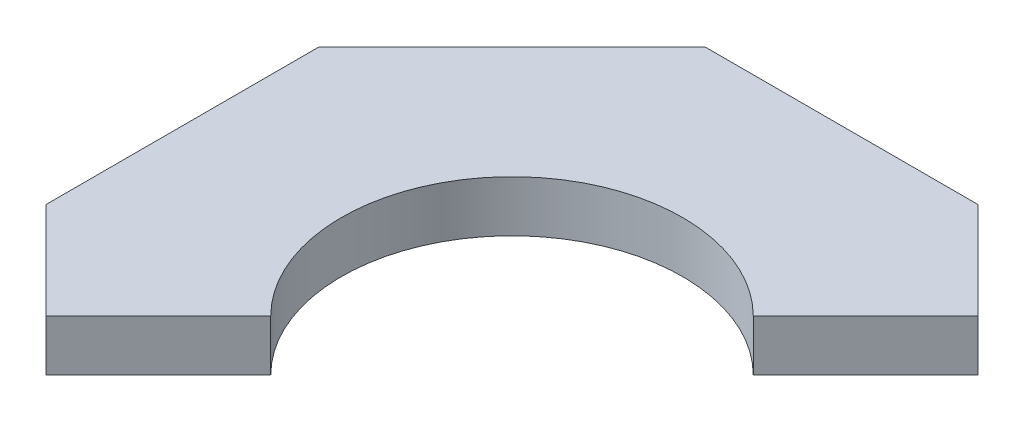
ISO-10303-21;
HEADER;
FILE_DESCRIPTION(('STEP AP214'),'2;1');
FILE_NAME('part.step','',(''),(''),'','','');
FILE_SCHEMA(('AUTOMOTIVE_DESIGN { 1 0 10303 214 1 1 1 1 }'));
ENDSEC;
DATA;
#1=APPLICATION_CONTEXT('core data for automotive mechanical design processes');
#2=APPLICATION_PROTOCOL_DEFINITION('international standard','automotive_design',2000,#1);
#3=PRODUCT_CONTEXT('',#1,'mechanical');
#4=PRODUCT('Part','Part','',(#3));
#5=PRODUCT_RELATED_PRODUCT_CATEGORY('part','',(#4));
#6=PRODUCT_DEFINITION_FORMATION('','',#4);
#7=PRODUCT_DEFINITION_CONTEXT('part definition',#1,'design');
#8=PRODUCT_DEFINITION('design','',#6,#7);
#9=PRODUCT_DEFINITION_SHAPE('','',#8);
#10=(LENGTH_UNIT() NAMED_UNIT(*) SI_UNIT(.MILLI.,.METRE.));
#11=(NAMED_UNIT(*) PLANE_ANGLE_UNIT() SI_UNIT($,.RADIAN.));
#12=(NAMED_UNIT(*) SI_UNIT($,.STERADIAN.) SOLID_ANGLE_UNIT());
#13=UNCERTAINTY_MEASURE_WITH_UNIT(LENGTH_MEASURE(1.E-05),#10,'distance_accuracy_value','');
#14=(GEOMETRIC_REPRESENTATION_CONTEXT(3) GLOBAL_UNCERTAINTY_ASSIGNED_CONTEXT((#13)) GLOBAL_UNIT_ASSIGNED_CONTEXT((#10,
#11,#12)) REPRESENTATION_CONTEXT('',''));
#15=CARTESIAN_POINT('',(0.,0.,0.));
#16=DIRECTION('',(0.,0.,1.));
#17=DIRECTION('',(1.,0.,0.));
#18=AXIS2_PLACEMENT_3D('',#15,#16,#17);
#19=CARTESIAN_POINT('',(-86.7210244842766,-0.00999999999999959,86.7210244842766));
#20=DIRECTION('',(0.707106781186547,0.,0.707106781186548));
#21=DIRECTION('',(0.707106781186548,0.,-0.707106781186547));
#22=AXIS2_PLACEMENT_3D('',#19,#20,#21);
#23=PLANE('',#22);
#24=DIRECTION('',(0.,1.,0.));
#25=VECTOR('',#24,1.);
#26=CARTESIAN_POINT('',(44.9012806053458,0.,-44.9012806053457));
#27=LINE('',#26,#25);
#28=CARTESIAN_POINT('',(44.9012806053458,19.05,-44.9012806053457));
#29=VERTEX_POINT('',#28);
#30=CARTESIAN_POINT('',(44.9012806053458,0.,-44.9012806053457));
#31=VERTEX_POINT('',#30);
#32=EDGE_CURVE('E109',#29,#31,#27,.F.);
#33=ORIENTED_EDGE('',*,*,#32,.T.);
#34=DIRECTION('',(0.707106781186548,0.,-0.707106781186547));
#35=VECTOR('',#34,1.);
#36=CARTESIAN_POINT('',(0.,0.,0.));
#37=LINE('',#36,#35);
#38=CARTESIAN_POINT('',(86.7210244842766,0.,-86.7210244842766));
#39=VERTEX_POINT('',#38);
#40=EDGE_CURVE('E116',#31,#39,#37,.T.);
#41=ORIENTED_EDGE('',*,*,#40,.T.);
#42=DIRECTION('',(0.,1.,0.));
#43=VECTOR('',#42,1.);
#44=CARTESIAN_POINT('',(86.7210244842766,19.05,-86.7210244842766));
#45=LINE('',#44,#43);
#46=CARTESIAN_POINT('',(86.7210244842766,19.05,-86.7210244842766));
#47=VERTEX_POINT('',#46);
#48=EDGE_CURVE('E152',#39,#47,#45,.T.);
#49=ORIENTED_EDGE('',*,*,#48,.T.);
#50=DIRECTION('',(0.707106781186548,0.,-0.707106781186547));
#51=VECTOR('',#50,1.);
#52=CARTESIAN_POINT('',(0.,19.05,0.));
#53=LINE('',#52,#51);
#54=EDGE_CURVE('E124',#29,#47,#53,.T.);
#55=ORIENTED_EDGE('',*,*,#54,.F.);
#56=EDGE_LOOP('',(#33,#41,#49,#55));
#57=FACE_BOUND('',#56,.T.);
#58=ADVANCED_FACE('F34',(#57),#23,.T.);
#59=DIRECTION('',(0.,-1.,0.));
#60=VECTOR('',#59,1.);
#61=CARTESIAN_POINT('',(-86.7210244842766,19.05,86.7210244842766));
#62=LINE('',#61,#60);
#63=CARTESIAN_POINT('',(-86.7210244842766,19.05,86.7210244842766));
#64=VERTEX_POINT('',#63);
#65=CARTESIAN_POINT('',(-86.7210244842766,0.,86.7210244842766));
#66=VERTEX_POINT('',#65);
#67=EDGE_CURVE('E153',#64,#66,#62,.T.);
#68=ORIENTED_EDGE('',*,*,#67,.T.);
#69=CARTESIAN_POINT('',(-44.9012806053458,0.,44.9012806053458));
#70=VERTEX_POINT('',#69);
#71=EDGE_CURVE('E121',#66,#70,#37,.T.);
#72=ORIENTED_EDGE('',*,*,#71,.T.);
#73=DIRECTION('',(0.,1.,0.));
#74=VECTOR('',#73,1.);
#75=CARTESIAN_POINT('',(-44.9012806053458,0.,44.9012806053458));
#76=LINE('',#75,#74);
#77=CARTESIAN_POINT('',(-44.9012806053458,19.05,44.9012806053458));
#78=VERTEX_POINT('',#77);
#79=EDGE_CURVE('E111',#70,#78,#76,.T.);
#80=ORIENTED_EDGE('',*,*,#79,.T.);
#81=EDGE_CURVE('E151',#64,#78,#53,.T.);
#82=ORIENTED_EDGE('',*,*,#81,.F.);
#83=EDGE_LOOP('',(#68,#72,#80,#82));
#84=FACE_BOUND('',#83,.T.);
#85=ADVANCED_FACE('F157',(#84),#23,.T.);
#86=CARTESIAN_POINT('',(122.642048968553,19.05,-50.8));
#87=DIRECTION('',(-0.707106781186548,0.,0.707106781186547));
#88=DIRECTION('',(0.707106781186547,0.,0.707106781186548));
#89=AXIS2_PLACEMENT_3D('',#86,#87,#88);
#90=PLANE('',#89);
#91=ORIENTED_EDGE('',*,*,#48,.F.);
#92=DIRECTION('',(-0.707106781186547,0.,-0.707106781186548));
#93=VECTOR('',#92,1.);
#94=CARTESIAN_POINT('',(122.642048968553,0.,-50.8));
#95=LINE('',#94,#93);
#96=CARTESIAN_POINT('',(50.8,0.,-122.642048968553));
#97=VERTEX_POINT('',#96);
#98=EDGE_CURVE('E51',#39,#97,#95,.T.);
#99=ORIENTED_EDGE('',*,*,#98,.T.);
#100=DIRECTION('',(0.,-1.,0.));
#101=VECTOR('',#100,1.);
#102=CARTESIAN_POINT('',(50.8,19.05,-122.642048968553));
#103=LINE('',#102,#101);
#104=CARTESIAN_POINT('',(50.8,19.05,-122.642048968553));
#105=VERTEX_POINT('',#104);
#106=EDGE_CURVE('E150',#105,#97,#103,.T.);
#107=ORIENTED_EDGE('',*,*,#106,.F.);
#108=DIRECTION('',(-0.707106781186547,0.,-0.707106781186548));
#109=VECTOR('',#108,1.);
#110=CARTESIAN_POINT('',(122.642048968553,19.05,-50.8));
#111=LINE('',#110,#109);
#112=EDGE_CURVE('E74',#47,#105,#111,.T.);
#113=ORIENTED_EDGE('',*,*,#112,.F.);
#114=EDGE_LOOP('',(#91,#99,#107,#113));
#115=FACE_BOUND('',#114,.T.);
#116=ADVANCED_FACE('F178',(#115),#90,.F.);
#117=CARTESIAN_POINT('',(-122.642048968553,19.05,50.7999999999999));
#118=DIRECTION('',(0.707106781186548,0.,-0.707106781186547));
#119=DIRECTION('',(-0.707106781186547,0.,-0.707106781186548));
#120=AXIS2_PLACEMENT_3D('',#117,#118,#119);
#121=PLANE('',#120);
#122=ORIENTED_EDGE('',*,*,#67,.F.);
#123=DIRECTION('',(0.707106781186547,0.,0.707106781186548));
#124=VECTOR('',#123,1.);
#125=CARTESIAN_POINT('',(-122.642048968553,19.05,50.7999999999999));
#126=LINE('',#125,#124);
#127=CARTESIAN_POINT('',(-122.642048968553,19.05,50.7999999999999));
#128=VERTEX_POINT('',#127);
#129=EDGE_CURVE('E129',#128,#64,#126,.T.);
#130=ORIENTED_EDGE('',*,*,#129,.F.);
#131=DIRECTION('',(0.,-1.,0.));
#132=VECTOR('',#131,1.);
#133=CARTESIAN_POINT('',(-122.642048968553,19.05,50.7999999999999));
#134=LINE('',#133,#132);
#135=CARTESIAN_POINT('',(-122.642048968553,0.,50.7999999999999));
#136=VERTEX_POINT('',#135);
#137=EDGE_CURVE('E133',#128,#136,#134,.T.);
#138=ORIENTED_EDGE('',*,*,#137,.T.);
#139=DIRECTION('',(0.707106781186547,0.,0.707106781186548));
#140=VECTOR('',#139,1.);
#141=CARTESIAN_POINT('',(-122.642048968553,0.,50.7999999999999));
#142=LINE('',#141,#140);
#143=EDGE_CURVE('E135',#136,#66,#142,.T.);
#144=ORIENTED_EDGE('',*,*,#143,.T.);
#145=EDGE_LOOP('',(#122,#130,#138,#144));
#146=FACE_BOUND('',#145,.T.);
#147=ADVANCED_FACE('F161',(#146),#121,.F.);
#148=CARTESIAN_POINT('',(0.,19.05,0.));
#149=DIRECTION('',(0.,1.,0.));
#150=DIRECTION('',(0.,0.,1.));
#151=AXIS2_PLACEMENT_3D('',#148,#149,#150);
#152=PLANE('',#151);
#153=ORIENTED_EDGE('',*,*,#129,.T.);
#154=ORIENTED_EDGE('',*,*,#81,.T.);
#155=CARTESIAN_POINT('',(0.,19.05,0.));
#156=DIRECTION('',(0.,1.,0.));
#157=DIRECTION('',(0.,0.,1.));
#158=AXIS2_PLACEMENT_3D('',#155,#156,#157);
#159=CIRCLE('',#158,63.5);
#160=EDGE_CURVE('E11',#29,#78,#159,.T.);
#161=ORIENTED_EDGE('',*,*,#160,.F.);
#162=ORIENTED_EDGE('',*,*,#54,.T.);
#163=ORIENTED_EDGE('',*,*,#112,.T.);
#164=DIRECTION('',(-1.,0.,0.));
#165=VECTOR('',#164,1.);
#166=CARTESIAN_POINT('',(50.8,19.05,-122.642048968553));
#167=LINE('',#166,#165);
#168=CARTESIAN_POINT('',(-50.8,19.05,-122.642048968553));
#169=VERTEX_POINT('',#168);
#170=EDGE_CURVE('E69',#105,#169,#167,.T.);
#171=ORIENTED_EDGE('',*,*,#170,.T.);
#172=DIRECTION('',(-0.707106781186548,0.,0.707106781186547));
#173=VECTOR('',#172,1.);
#174=CARTESIAN_POINT('',(-50.8,19.05,-122.642048968553));
#175=LINE('',#174,#173);
#176=CARTESIAN_POINT('',(-122.642048968553,19.05,-50.8));
#177=VERTEX_POINT('',#176);
#178=EDGE_CURVE('E146',#169,#177,#175,.T.);
#179=ORIENTED_EDGE('',*,*,#178,.T.);
#180=DIRECTION('',(0.,0.,1.));
#181=VECTOR('',#180,1.);
#182=CARTESIAN_POINT('',(-122.642048968553,19.05,-50.8));
#183=LINE('',#182,#181);
#184=EDGE_CURVE('E132',#177,#128,#183,.T.);
#185=ORIENTED_EDGE('',*,*,#184,.T.);
#186=EDGE_LOOP('',(#153,#154,#161,#162,#163,#171,#179,#185));
#187=FACE_BOUND('',#186,.T.);
#188=ADVANCED_FACE('F176',(#187),#152,.T.);
#189=CARTESIAN_POINT('',(0.,0.,0.));
#190=DIRECTION('',(0.,1.,0.));
#191=DIRECTION('',(0.,0.,1.));
#192=AXIS2_PLACEMENT_3D('',#189,#190,#191);
#193=PLANE('',#192);
#194=ORIENTED_EDGE('',*,*,#71,.F.);
#195=ORIENTED_EDGE('',*,*,#143,.F.);
#196=DIRECTION('',(0.,0.,1.));
#197=VECTOR('',#196,1.);
#198=CARTESIAN_POINT('',(-122.642048968553,0.,-50.8));
#199=LINE('',#198,#197);
#200=CARTESIAN_POINT('',(-122.642048968553,0.,-50.8));
#201=VERTEX_POINT('',#200);
#202=EDGE_CURVE('E81',#201,#136,#199,.T.);
#203=ORIENTED_EDGE('',*,*,#202,.F.);
#204=DIRECTION('',(-0.707106781186548,0.,0.707106781186547));
#205=VECTOR('',#204,1.);
#206=CARTESIAN_POINT('',(-50.8,0.,-122.642048968553));
#207=LINE('',#206,#205);
#208=CARTESIAN_POINT('',(-50.8,0.,-122.642048968553));
#209=VERTEX_POINT('',#208);
#210=EDGE_CURVE('E138',#209,#201,#207,.T.);
#211=ORIENTED_EDGE('',*,*,#210,.F.);
#212=DIRECTION('',(-1.,0.,0.));
#213=VECTOR('',#212,1.);
#214=CARTESIAN_POINT('',(50.8,0.,-122.642048968553));
#215=LINE('',#214,#213);
#216=EDGE_CURVE('E137',#97,#209,#215,.T.);
#217=ORIENTED_EDGE('',*,*,#216,.F.);
#218=ORIENTED_EDGE('',*,*,#98,.F.);
#219=ORIENTED_EDGE('',*,*,#40,.F.);
#220=CARTESIAN_POINT('',(0.,0.,0.));
#221=DIRECTION('',(0.,1.,0.));
#222=DIRECTION('',(0.,0.,1.));
#223=AXIS2_PLACEMENT_3D('',#220,#221,#222);
#224=CIRCLE('',#223,63.5);
#225=EDGE_CURVE('E43',#31,#70,#224,.T.);
#226=ORIENTED_EDGE('',*,*,#225,.T.);
#227=EDGE_LOOP('',(#194,#195,#203,#211,#217,#218,#219,#226));
#228=FACE_BOUND('',#227,.T.);
#229=ADVANCED_FACE('F117',(#228),#193,.F.);
#230=CARTESIAN_POINT('',(0.,0.,0.));
#231=DIRECTION('',(0.,1.,0.));
#232=DIRECTION('',(0.,0.,1.));
#233=AXIS2_PLACEMENT_3D('',#230,#231,#232);
#234=CYLINDRICAL_SURFACE('',#233,63.5);
#235=ORIENTED_EDGE('',*,*,#32,.F.);
#236=ORIENTED_EDGE('',*,*,#160,.T.);
#237=ORIENTED_EDGE('',*,*,#79,.F.);
#238=ORIENTED_EDGE('',*,*,#225,.F.);
#239=EDGE_LOOP('',(#235,#236,#237,#238));
#240=FACE_BOUND('',#239,.T.);
#241=ADVANCED_FACE('F36',(#240),#234,.F.);
#242=CARTESIAN_POINT('',(50.8,19.05,-122.642048968553));
#243=DIRECTION('',(0.,0.,1.));
#244=DIRECTION('',(1.,0.,0.));
#245=AXIS2_PLACEMENT_3D('',#242,#243,#244);
#246=PLANE('',#245);
#247=ORIENTED_EDGE('',*,*,#216,.T.);
#248=DIRECTION('',(0.,-1.,0.));
#249=VECTOR('',#248,1.);
#250=CARTESIAN_POINT('',(-50.8,19.05,-122.642048968553));
#251=LINE('',#250,#249);
#252=EDGE_CURVE('E166',#169,#209,#251,.T.);
#253=ORIENTED_EDGE('',*,*,#252,.F.);
#254=ORIENTED_EDGE('',*,*,#170,.F.);
#255=ORIENTED_EDGE('',*,*,#106,.T.);
#256=EDGE_LOOP('',(#247,#253,#254,#255));
#257=FACE_BOUND('',#256,.T.);
#258=ADVANCED_FACE('F170',(#257),#246,.F.);
#259=CARTESIAN_POINT('',(-50.8,19.05,-122.642048968553));
#260=DIRECTION('',(0.707106781186547,0.,0.707106781186548));
#261=DIRECTION('',(0.707106781186548,0.,-0.707106781186547));
#262=AXIS2_PLACEMENT_3D('',#259,#260,#261);
#263=PLANE('',#262);
#264=ORIENTED_EDGE('',*,*,#210,.T.);
#265=DIRECTION('',(0.,-1.,0.));
#266=VECTOR('',#265,1.);
#267=CARTESIAN_POINT('',(-122.642048968553,19.05,-50.8));
#268=LINE('',#267,#266);
#269=EDGE_CURVE('E164',#177,#201,#268,.T.);
#270=ORIENTED_EDGE('',*,*,#269,.F.);
#271=ORIENTED_EDGE('',*,*,#178,.F.);
#272=ORIENTED_EDGE('',*,*,#252,.T.);
#273=EDGE_LOOP('',(#264,#270,#271,#272));
#274=FACE_BOUND('',#273,.T.);
#275=ADVANCED_FACE('F173',(#274),#263,.F.);
#276=CARTESIAN_POINT('',(-122.642048968553,19.05,-50.8));
#277=DIRECTION('',(1.,0.,0.));
#278=DIRECTION('',(0.,0.,-1.));
#279=AXIS2_PLACEMENT_3D('',#276,#277,#278);
#280=PLANE('',#279);
#281=ORIENTED_EDGE('',*,*,#202,.T.);
#282=ORIENTED_EDGE('',*,*,#137,.F.);
#283=ORIENTED_EDGE('',*,*,#184,.F.);
#284=ORIENTED_EDGE('',*,*,#269,.T.);
#285=EDGE_LOOP('',(#281,#282,#283,#284));
#286=FACE_BOUND('',#285,.T.);
#287=ADVANCED_FACE('F175',(#286),#280,.F.);
#288=CLOSED_SHELL('',(#58,#85,#116,#147,#188,#229,#241,#258,#275,#287));
#289=MANIFOLD_SOLID_BREP('B2',#288);
#290=ADVANCED_BREP_SHAPE_REPRESENTATION('',(#18,#289),#14);
#291=SHAPE_DEFINITION_REPRESENTATION(#9,#290);
ENDSEC;
END-ISO-10303-21;
